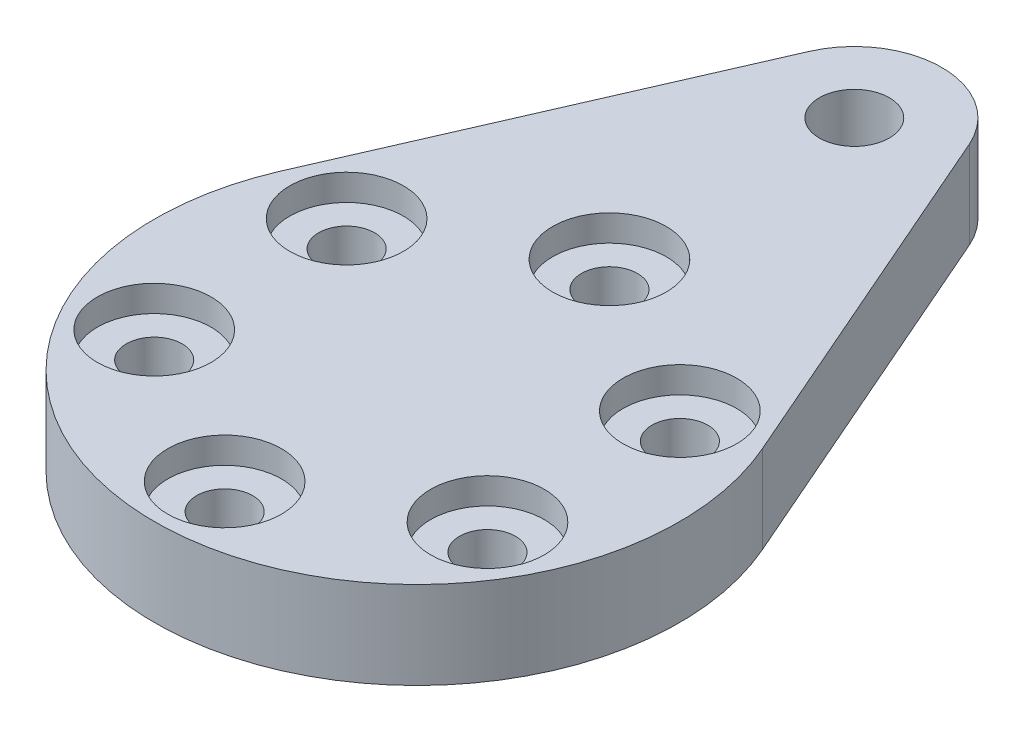
ISO-10303-21;
HEADER;
FILE_DESCRIPTION(('STEP AP214'),'2;1');
FILE_NAME('part.step','',(''),(''),'','','');
FILE_SCHEMA(('AUTOMOTIVE_DESIGN { 1 0 10303 214 1 1 1 1 }'));
ENDSEC;
DATA;
#1=APPLICATION_CONTEXT('core data for automotive mechanical design processes');
#2=APPLICATION_PROTOCOL_DEFINITION('international standard','automotive_design',2000,#1);
#3=PRODUCT_CONTEXT('',#1,'mechanical');
#4=PRODUCT('Part','Part','',(#3));
#5=PRODUCT_RELATED_PRODUCT_CATEGORY('part','',(#4));
#6=PRODUCT_DEFINITION_FORMATION('','',#4);
#7=PRODUCT_DEFINITION_CONTEXT('part definition',#1,'design');
#8=PRODUCT_DEFINITION('design','',#6,#7);
#9=PRODUCT_DEFINITION_SHAPE('','',#8);
#10=(LENGTH_UNIT() NAMED_UNIT(*) SI_UNIT(.MILLI.,.METRE.));
#11=(NAMED_UNIT(*) PLANE_ANGLE_UNIT() SI_UNIT($,.RADIAN.));
#12=(NAMED_UNIT(*) SI_UNIT($,.STERADIAN.) SOLID_ANGLE_UNIT());
#13=UNCERTAINTY_MEASURE_WITH_UNIT(LENGTH_MEASURE(1.E-05),#10,'distance_accuracy_value','');
#14=(GEOMETRIC_REPRESENTATION_CONTEXT(3) GLOBAL_UNCERTAINTY_ASSIGNED_CONTEXT((#13)) GLOBAL_UNIT_ASSIGNED_CONTEXT((#10,
#11,#12)) REPRESENTATION_CONTEXT('',''));
#15=CARTESIAN_POINT('',(0.,0.,0.));
#16=DIRECTION('',(0.,0.,1.));
#17=DIRECTION('',(1.,0.,0.));
#18=AXIS2_PLACEMENT_3D('',#15,#16,#17);
#19=CARTESIAN_POINT('',(9.52627944162909,5.,-5.50000000000046));
#20=DIRECTION('',(0.,-1.,0.));
#21=DIRECTION('',(0.,0.,-1.));
#22=AXIS2_PLACEMENT_3D('',#19,#20,#21);
#23=CYLINDRICAL_SURFACE('',#22,1.6);
#24=CARTESIAN_POINT('',(9.52627944162909,0.,-5.50000000000046));
#25=DIRECTION('',(0.,1.,0.));
#26=DIRECTION('',(0.,0.,1.));
#27=AXIS2_PLACEMENT_3D('',#24,#25,#26);
#28=CIRCLE('',#27,1.6);
#29=CARTESIAN_POINT('',(9.52627944162909,0.,-3.90000000000046));
#30=VERTEX_POINT('',#29);
#31=EDGE_CURVE('E125',#30,#30,#28,.T.);
#32=ORIENTED_EDGE('',*,*,#31,.F.);
#33=EDGE_LOOP('',(#32));
#34=FACE_BOUND('',#33,.T.);
#35=CARTESIAN_POINT('',(9.52627944162909,3.5,-5.50000000000046));
#36=DIRECTION('',(0.,1.,0.));
#37=DIRECTION('',(0.,0.,1.));
#38=AXIS2_PLACEMENT_3D('',#35,#36,#37);
#39=CIRCLE('',#38,1.6);
#40=CARTESIAN_POINT('',(9.52627944162909,3.5,-3.90000000000046));
#41=VERTEX_POINT('',#40);
#42=EDGE_CURVE('E39',#41,#41,#39,.T.);
#43=ORIENTED_EDGE('',*,*,#42,.T.);
#44=EDGE_LOOP('',(#43));
#45=FACE_BOUND('',#44,.T.);
#46=ADVANCED_FACE('F35',(#34,#45),#23,.F.);
#47=CARTESIAN_POINT('',(9.52627944162962,5.,5.49999999999954));
#48=DIRECTION('',(0.,-1.,0.));
#49=DIRECTION('',(0.,0.,-1.));
#50=AXIS2_PLACEMENT_3D('',#47,#48,#49);
#51=CYLINDRICAL_SURFACE('',#50,1.6);
#52=CARTESIAN_POINT('',(9.52627944162962,0.,5.49999999999954));
#53=DIRECTION('',(0.,1.,0.));
#54=DIRECTION('',(0.,0.,1.));
#55=AXIS2_PLACEMENT_3D('',#52,#53,#54);
#56=CIRCLE('',#55,1.6);
#57=CARTESIAN_POINT('',(9.52627944162962,0.,7.09999999999954));
#58=VERTEX_POINT('',#57);
#59=EDGE_CURVE('E122',#58,#58,#56,.T.);
#60=ORIENTED_EDGE('',*,*,#59,.F.);
#61=EDGE_LOOP('',(#60));
#62=FACE_BOUND('',#61,.T.);
#63=CARTESIAN_POINT('',(9.52627944162962,3.5,5.49999999999954));
#64=DIRECTION('',(0.,1.,0.));
#65=DIRECTION('',(0.,0.,1.));
#66=AXIS2_PLACEMENT_3D('',#63,#64,#65);
#67=CIRCLE('',#66,1.6);
#68=CARTESIAN_POINT('',(9.52627944162962,3.5,7.09999999999954));
#69=VERTEX_POINT('',#68);
#70=EDGE_CURVE('E146',#69,#69,#67,.T.);
#71=ORIENTED_EDGE('',*,*,#70,.T.);
#72=EDGE_LOOP('',(#71));
#73=FACE_BOUND('',#72,.T.);
#74=ADVANCED_FACE('F216',(#62,#73),#51,.F.);
#75=CARTESIAN_POINT('',(1.06103798112348E-12,5.,11.));
#76=DIRECTION('',(0.,-1.,0.));
#77=DIRECTION('',(0.,0.,-1.));
#78=AXIS2_PLACEMENT_3D('',#75,#76,#77);
#79=CYLINDRICAL_SURFACE('',#78,1.6);
#80=CARTESIAN_POINT('',(1.06103798112348E-12,0.,11.));
#81=DIRECTION('',(0.,1.,0.));
#82=DIRECTION('',(0.,0.,1.));
#83=AXIS2_PLACEMENT_3D('',#80,#81,#82);
#84=CIRCLE('',#83,1.6);
#85=CARTESIAN_POINT('',(1.06103798112348E-12,0.,12.6));
#86=VERTEX_POINT('',#85);
#87=EDGE_CURVE('E119',#86,#86,#84,.T.);
#88=ORIENTED_EDGE('',*,*,#87,.F.);
#89=EDGE_LOOP('',(#88));
#90=FACE_BOUND('',#89,.T.);
#91=CARTESIAN_POINT('',(1.06103798112348E-12,3.5,11.));
#92=DIRECTION('',(0.,1.,0.));
#93=DIRECTION('',(0.,0.,1.));
#94=AXIS2_PLACEMENT_3D('',#91,#92,#93);
#95=CIRCLE('',#94,1.6);
#96=CARTESIAN_POINT('',(1.06103798112348E-12,3.5,12.6));
#97=VERTEX_POINT('',#96);
#98=EDGE_CURVE('E144',#97,#97,#95,.T.);
#99=ORIENTED_EDGE('',*,*,#98,.T.);
#100=EDGE_LOOP('',(#99));
#101=FACE_BOUND('',#100,.T.);
#102=ADVANCED_FACE('F222',(#90,#101),#79,.F.);
#103=CARTESIAN_POINT('',(-9.52627944162803,5.,5.50000000000046));
#104=DIRECTION('',(0.,-1.,0.));
#105=DIRECTION('',(0.,0.,-1.));
#106=AXIS2_PLACEMENT_3D('',#103,#104,#105);
#107=CYLINDRICAL_SURFACE('',#106,1.6);
#108=CARTESIAN_POINT('',(-9.52627944162803,0.,5.50000000000046));
#109=DIRECTION('',(0.,1.,0.));
#110=DIRECTION('',(0.,0.,1.));
#111=AXIS2_PLACEMENT_3D('',#108,#109,#110);
#112=CIRCLE('',#111,1.6);
#113=CARTESIAN_POINT('',(-9.52627944162803,0.,7.10000000000046));
#114=VERTEX_POINT('',#113);
#115=EDGE_CURVE('E116',#114,#114,#112,.T.);
#116=ORIENTED_EDGE('',*,*,#115,.F.);
#117=EDGE_LOOP('',(#116));
#118=FACE_BOUND('',#117,.T.);
#119=CARTESIAN_POINT('',(-9.52627944162803,3.5,5.50000000000046));
#120=DIRECTION('',(0.,1.,0.));
#121=DIRECTION('',(0.,0.,1.));
#122=AXIS2_PLACEMENT_3D('',#119,#120,#121);
#123=CIRCLE('',#122,1.6);
#124=CARTESIAN_POINT('',(-9.52627944162803,3.5,7.10000000000046));
#125=VERTEX_POINT('',#124);
#126=EDGE_CURVE('E141',#125,#125,#123,.T.);
#127=ORIENTED_EDGE('',*,*,#126,.T.);
#128=EDGE_LOOP('',(#127));
#129=FACE_BOUND('',#128,.T.);
#130=ADVANCED_FACE('F231',(#118,#129),#107,.F.);
#131=CARTESIAN_POINT('',(-9.52627944162856,5.,-5.49999999999953));
#132=DIRECTION('',(0.,-1.,0.));
#133=DIRECTION('',(0.,0.,-1.));
#134=AXIS2_PLACEMENT_3D('',#131,#132,#133);
#135=CYLINDRICAL_SURFACE('',#134,1.6);
#136=CARTESIAN_POINT('',(-9.52627944162856,0.,-5.49999999999953));
#137=DIRECTION('',(0.,1.,0.));
#138=DIRECTION('',(0.,0.,1.));
#139=AXIS2_PLACEMENT_3D('',#136,#137,#138);
#140=CIRCLE('',#139,1.6);
#141=CARTESIAN_POINT('',(-9.52627944162856,0.,-3.89999999999953));
#142=VERTEX_POINT('',#141);
#143=EDGE_CURVE('E113',#142,#142,#140,.T.);
#144=ORIENTED_EDGE('',*,*,#143,.F.);
#145=EDGE_LOOP('',(#144));
#146=FACE_BOUND('',#145,.T.);
#147=CARTESIAN_POINT('',(-9.52627944162856,3.5,-5.49999999999953));
#148=DIRECTION('',(0.,1.,0.));
#149=DIRECTION('',(0.,0.,1.));
#150=AXIS2_PLACEMENT_3D('',#147,#148,#149);
#151=CIRCLE('',#150,1.6);
#152=CARTESIAN_POINT('',(-9.52627944162856,3.5,-3.89999999999953));
#153=VERTEX_POINT('',#152);
#154=EDGE_CURVE('E137',#153,#153,#151,.T.);
#155=ORIENTED_EDGE('',*,*,#154,.T.);
#156=EDGE_LOOP('',(#155));
#157=FACE_BOUND('',#156,.T.);
#158=ADVANCED_FACE('F235',(#146,#157),#135,.F.);
#159=CARTESIAN_POINT('',(0.,5.,-11.));
#160=DIRECTION('',(0.,-1.,0.));
#161=DIRECTION('',(0.,0.,-1.));
#162=AXIS2_PLACEMENT_3D('',#159,#160,#161);
#163=CYLINDRICAL_SURFACE('',#162,1.6);
#164=CARTESIAN_POINT('',(0.,0.,-11.));
#165=DIRECTION('',(0.,1.,0.));
#166=DIRECTION('',(0.,0.,1.));
#167=AXIS2_PLACEMENT_3D('',#164,#165,#166);
#168=CIRCLE('',#167,1.6);
#169=CARTESIAN_POINT('',(0.,0.,-9.4));
#170=VERTEX_POINT('',#169);
#171=EDGE_CURVE('E128',#170,#170,#168,.T.);
#172=ORIENTED_EDGE('',*,*,#171,.F.);
#173=EDGE_LOOP('',(#172));
#174=FACE_BOUND('',#173,.T.);
#175=CARTESIAN_POINT('',(0.,3.5,-11.));
#176=DIRECTION('',(0.,1.,0.));
#177=DIRECTION('',(0.,0.,1.));
#178=AXIS2_PLACEMENT_3D('',#175,#176,#177);
#179=CIRCLE('',#178,1.6);
#180=CARTESIAN_POINT('',(0.,3.5,-9.4));
#181=VERTEX_POINT('',#180);
#182=EDGE_CURVE('E134',#181,#181,#179,.T.);
#183=ORIENTED_EDGE('',*,*,#182,.T.);
#184=EDGE_LOOP('',(#183));
#185=FACE_BOUND('',#184,.T.);
#186=ADVANCED_FACE('F227',(#174,#185),#163,.F.);
#187=CARTESIAN_POINT('',(0.,5.,-25.));
#188=DIRECTION('',(0.,-1.,0.));
#189=DIRECTION('',(0.,0.,-1.));
#190=AXIS2_PLACEMENT_3D('',#187,#188,#189);
#191=CYLINDRICAL_SURFACE('',#190,5.);
#192=CARTESIAN_POINT('',(0.,0.,-25.));
#193=DIRECTION('',(0.,1.,0.));
#194=DIRECTION('',(0.,0.,1.));
#195=AXIS2_PLACEMENT_3D('',#192,#193,#194);
#196=CIRCLE('',#195,5.);
#197=CARTESIAN_POINT('',(4.58257569495584,0.,-27.));
#198=VERTEX_POINT('',#197);
#199=CARTESIAN_POINT('',(-4.58257569495584,0.,-27.));
#200=VERTEX_POINT('',#199);
#201=EDGE_CURVE('E105',#198,#200,#196,.T.);
#202=ORIENTED_EDGE('',*,*,#201,.T.);
#203=DIRECTION('',(0.,-1.,0.));
#204=VECTOR('',#203,1.);
#205=CARTESIAN_POINT('',(-4.58257569495584,5.,-27.));
#206=LINE('',#205,#204);
#207=CARTESIAN_POINT('',(-4.58257569495584,5.,-27.));
#208=VERTEX_POINT('',#207);
#209=EDGE_CURVE('E11',#208,#200,#206,.T.);
#210=ORIENTED_EDGE('',*,*,#209,.F.);
#211=CARTESIAN_POINT('',(0.,5.,-25.));
#212=DIRECTION('',(0.,1.,0.));
#213=DIRECTION('',(0.,0.,1.));
#214=AXIS2_PLACEMENT_3D('',#211,#212,#213);
#215=CIRCLE('',#214,5.);
#216=CARTESIAN_POINT('',(4.58257569495584,5.,-27.));
#217=VERTEX_POINT('',#216);
#218=EDGE_CURVE('E87',#217,#208,#215,.T.);
#219=ORIENTED_EDGE('',*,*,#218,.F.);
#220=DIRECTION('',(0.,-1.,0.));
#221=VECTOR('',#220,1.);
#222=CARTESIAN_POINT('',(4.58257569495584,5.,-27.));
#223=LINE('',#222,#221);
#224=EDGE_CURVE('E54',#217,#198,#223,.T.);
#225=ORIENTED_EDGE('',*,*,#224,.T.);
#226=EDGE_LOOP('',(#202,#210,#219,#225));
#227=FACE_BOUND('',#226,.T.);
#228=ADVANCED_FACE('F245',(#227),#191,.T.);
#229=CARTESIAN_POINT('',(-13.7477270848675,5.,-6.));
#230=DIRECTION('',(0.916515138991168,0.,0.4));
#231=DIRECTION('',(0.4,0.,-0.916515138991168));
#232=AXIS2_PLACEMENT_3D('',#229,#230,#231);
#233=PLANE('',#232);
#234=DIRECTION('',(-0.4,0.,0.916515138991168));
#235=VECTOR('',#234,1.);
#236=CARTESIAN_POINT('',(-13.7477270848675,0.,-6.));
#237=LINE('',#236,#235);
#238=CARTESIAN_POINT('',(-13.7477270848675,0.,-6.));
#239=VERTEX_POINT('',#238);
#240=EDGE_CURVE('E92',#200,#239,#237,.T.);
#241=ORIENTED_EDGE('',*,*,#240,.T.);
#242=DIRECTION('',(0.,-1.,0.));
#243=VECTOR('',#242,1.);
#244=CARTESIAN_POINT('',(-13.7477270848675,5.,-6.));
#245=LINE('',#244,#243);
#246=CARTESIAN_POINT('',(-13.7477270848675,5.,-6.));
#247=VERTEX_POINT('',#246);
#248=EDGE_CURVE('E45',#247,#239,#245,.T.);
#249=ORIENTED_EDGE('',*,*,#248,.F.);
#250=DIRECTION('',(-0.4,0.,0.916515138991168));
#251=VECTOR('',#250,1.);
#252=CARTESIAN_POINT('',(-13.7477270848675,5.,-6.));
#253=LINE('',#252,#251);
#254=EDGE_CURVE('E80',#208,#247,#253,.T.);
#255=ORIENTED_EDGE('',*,*,#254,.F.);
#256=ORIENTED_EDGE('',*,*,#209,.T.);
#257=EDGE_LOOP('',(#241,#249,#255,#256));
#258=FACE_BOUND('',#257,.T.);
#259=ADVANCED_FACE('F91',(#258),#233,.F.);
#260=CARTESIAN_POINT('',(0.,5.,0.));
#261=DIRECTION('',(0.,-1.,0.));
#262=DIRECTION('',(0.,0.,-1.));
#263=AXIS2_PLACEMENT_3D('',#260,#261,#262);
#264=CYLINDRICAL_SURFACE('',#263,15.);
#265=CARTESIAN_POINT('',(0.,0.,0.));
#266=DIRECTION('',(0.,1.,0.));
#267=DIRECTION('',(0.,0.,1.));
#268=AXIS2_PLACEMENT_3D('',#265,#266,#267);
#269=CIRCLE('',#268,15.);
#270=CARTESIAN_POINT('',(13.7477270848675,0.,-6.));
#271=VERTEX_POINT('',#270);
#272=EDGE_CURVE('E108',#239,#271,#269,.T.);
#273=ORIENTED_EDGE('',*,*,#272,.T.);
#274=DIRECTION('',(0.,-1.,0.));
#275=VECTOR('',#274,1.);
#276=CARTESIAN_POINT('',(13.7477270848675,5.,-6.));
#277=LINE('',#276,#275);
#278=CARTESIAN_POINT('',(13.7477270848675,5.,-6.));
#279=VERTEX_POINT('',#278);
#280=EDGE_CURVE('E69',#279,#271,#277,.T.);
#281=ORIENTED_EDGE('',*,*,#280,.F.);
#282=CARTESIAN_POINT('',(0.,5.,0.));
#283=DIRECTION('',(0.,1.,0.));
#284=DIRECTION('',(0.,0.,1.));
#285=AXIS2_PLACEMENT_3D('',#282,#283,#284);
#286=CIRCLE('',#285,15.);
#287=EDGE_CURVE('E86',#247,#279,#286,.T.);
#288=ORIENTED_EDGE('',*,*,#287,.F.);
#289=ORIENTED_EDGE('',*,*,#248,.T.);
#290=EDGE_LOOP('',(#273,#281,#288,#289));
#291=FACE_BOUND('',#290,.T.);
#292=ADVANCED_FACE('F96',(#291),#264,.T.);
#293=CARTESIAN_POINT('',(13.7477270848675,5.,-6.));
#294=DIRECTION('',(0.916515138991168,0.,-0.4));
#295=DIRECTION('',(-0.4,0.,-0.916515138991168));
#296=AXIS2_PLACEMENT_3D('',#293,#294,#295);
#297=PLANE('',#296);
#298=DIRECTION('',(0.4,0.,0.916515138991168));
#299=VECTOR('',#298,1.);
#300=CARTESIAN_POINT('',(13.7477270848675,0.,-6.));
#301=LINE('',#300,#299);
#302=EDGE_CURVE('E110',#198,#271,#301,.T.);
#303=ORIENTED_EDGE('',*,*,#302,.F.);
#304=ORIENTED_EDGE('',*,*,#224,.F.);
#305=DIRECTION('',(0.4,0.,0.916515138991168));
#306=VECTOR('',#305,1.);
#307=CARTESIAN_POINT('',(13.7477270848675,5.,-6.));
#308=LINE('',#307,#306);
#309=EDGE_CURVE('E97',#217,#279,#308,.T.);
#310=ORIENTED_EDGE('',*,*,#309,.T.);
#311=ORIENTED_EDGE('',*,*,#280,.T.);
#312=EDGE_LOOP('',(#303,#304,#310,#311));
#313=FACE_BOUND('',#312,.T.);
#314=ADVANCED_FACE('F211',(#313),#297,.T.);
#315=CARTESIAN_POINT('',(0.,5.,-25.));
#316=DIRECTION('',(0.,-1.,0.));
#317=DIRECTION('',(0.,0.,-1.));
#318=AXIS2_PLACEMENT_3D('',#315,#316,#317);
#319=CYLINDRICAL_SURFACE('',#318,2.);
#320=CARTESIAN_POINT('',(0.,5.,-25.));
#321=DIRECTION('',(0.,1.,0.));
#322=DIRECTION('',(0.,0.,1.));
#323=AXIS2_PLACEMENT_3D('',#320,#321,#322);
#324=CIRCLE('',#323,2.);
#325=CARTESIAN_POINT('',(0.,5.,-23.));
#326=VERTEX_POINT('',#325);
#327=EDGE_CURVE('E131',#326,#326,#324,.T.);
#328=ORIENTED_EDGE('',*,*,#327,.T.);
#329=EDGE_LOOP('',(#328));
#330=FACE_BOUND('',#329,.T.);
#331=CARTESIAN_POINT('',(0.,0.,-25.));
#332=DIRECTION('',(0.,1.,0.));
#333=DIRECTION('',(0.,0.,1.));
#334=AXIS2_PLACEMENT_3D('',#331,#332,#333);
#335=CIRCLE('',#334,2.);
#336=CARTESIAN_POINT('',(0.,0.,-23.));
#337=VERTEX_POINT('',#336);
#338=EDGE_CURVE('E102',#337,#337,#335,.T.);
#339=ORIENTED_EDGE('',*,*,#338,.F.);
#340=EDGE_LOOP('',(#339));
#341=FACE_BOUND('',#340,.T.);
#342=ADVANCED_FACE('F37',(#330,#341),#319,.F.);
#343=CARTESIAN_POINT('',(0.,5.,0.));
#344=DIRECTION('',(0.,1.,0.));
#345=DIRECTION('',(0.,0.,1.));
#346=AXIS2_PLACEMENT_3D('',#343,#344,#345);
#347=PLANE('',#346);
#348=CARTESIAN_POINT('',(9.52627944162882,5.,-5.5));
#349=DIRECTION('',(0.,1.,0.));
#350=DIRECTION('',(0.,0.,1.));
#351=AXIS2_PLACEMENT_3D('',#348,#349,#350);
#352=CIRCLE('',#351,3.25);
#353=CARTESIAN_POINT('',(9.52627944162882,5.,-2.25));
#354=VERTEX_POINT('',#353);
#355=EDGE_CURVE('E164',#354,#354,#352,.T.);
#356=ORIENTED_EDGE('',*,*,#355,.F.);
#357=EDGE_LOOP('',(#356));
#358=FACE_BOUND('',#357,.T.);
#359=CARTESIAN_POINT('',(9.52627944162883,5.,5.5));
#360=DIRECTION('',(0.,1.,0.));
#361=DIRECTION('',(0.,0.,1.));
#362=AXIS2_PLACEMENT_3D('',#359,#360,#361);
#363=CIRCLE('',#362,3.25);
#364=CARTESIAN_POINT('',(9.52627944162883,5.,8.75));
#365=VERTEX_POINT('',#364);
#366=EDGE_CURVE('E177',#365,#365,#363,.T.);
#367=ORIENTED_EDGE('',*,*,#366,.F.);
#368=EDGE_LOOP('',(#367));
#369=FACE_BOUND('',#368,.T.);
#370=CARTESIAN_POINT('',(0.,5.,11.));
#371=DIRECTION('',(0.,1.,0.));
#372=DIRECTION('',(0.,0.,1.));
#373=AXIS2_PLACEMENT_3D('',#370,#371,#372);
#374=CIRCLE('',#373,3.25);
#375=CARTESIAN_POINT('',(0.,5.,14.25));
#376=VERTEX_POINT('',#375);
#377=EDGE_CURVE('E183',#376,#376,#374,.T.);
#378=ORIENTED_EDGE('',*,*,#377,.F.);
#379=EDGE_LOOP('',(#378));
#380=FACE_BOUND('',#379,.T.);
#381=CARTESIAN_POINT('',(-9.52627944162882,5.,5.50000000000001));
#382=DIRECTION('',(0.,1.,0.));
#383=DIRECTION('',(0.,0.,1.));
#384=AXIS2_PLACEMENT_3D('',#381,#382,#383);
#385=CIRCLE('',#384,3.25);
#386=CARTESIAN_POINT('',(-9.52627944162882,5.,8.75));
#387=VERTEX_POINT('',#386);
#388=EDGE_CURVE('E189',#387,#387,#385,.T.);
#389=ORIENTED_EDGE('',*,*,#388,.F.);
#390=EDGE_LOOP('',(#389));
#391=FACE_BOUND('',#390,.T.);
#392=CARTESIAN_POINT('',(-9.52627944162883,5.,-5.49999999999999));
#393=DIRECTION('',(0.,1.,0.));
#394=DIRECTION('',(0.,0.,1.));
#395=AXIS2_PLACEMENT_3D('',#392,#393,#394);
#396=CIRCLE('',#395,3.25);
#397=CARTESIAN_POINT('',(-9.52627944162883,5.,-2.24999999999999));
#398=VERTEX_POINT('',#397);
#399=EDGE_CURVE('E172',#398,#398,#396,.T.);
#400=ORIENTED_EDGE('',*,*,#399,.F.);
#401=EDGE_LOOP('',(#400));
#402=FACE_BOUND('',#401,.T.);
#403=CARTESIAN_POINT('',(0.,5.,-11.));
#404=DIRECTION('',(0.,1.,0.));
#405=DIRECTION('',(0.,0.,1.));
#406=AXIS2_PLACEMENT_3D('',#403,#404,#405);
#407=CIRCLE('',#406,3.25);
#408=CARTESIAN_POINT('',(0.,5.,-7.75));
#409=VERTEX_POINT('',#408);
#410=EDGE_CURVE('E163',#409,#409,#407,.T.);
#411=ORIENTED_EDGE('',*,*,#410,.F.);
#412=EDGE_LOOP('',(#411));
#413=FACE_BOUND('',#412,.T.);
#414=ORIENTED_EDGE('',*,*,#327,.F.);
#415=EDGE_LOOP('',(#414));
#416=FACE_BOUND('',#415,.T.);
#417=ORIENTED_EDGE('',*,*,#218,.T.);
#418=ORIENTED_EDGE('',*,*,#254,.T.);
#419=ORIENTED_EDGE('',*,*,#287,.T.);
#420=ORIENTED_EDGE('',*,*,#309,.F.);
#421=EDGE_LOOP('',(#417,#418,#419,#420));
#422=FACE_BOUND('',#421,.T.);
#423=ADVANCED_FACE('F83',(#358,#369,#380,#391,#402,#413,#416,#422),#347,.T.);
#424=CARTESIAN_POINT('',(0.,0.,0.));
#425=DIRECTION('',(0.,1.,0.));
#426=DIRECTION('',(0.,0.,1.));
#427=AXIS2_PLACEMENT_3D('',#424,#425,#426);
#428=PLANE('',#427);
#429=ORIENTED_EDGE('',*,*,#338,.T.);
#430=EDGE_LOOP('',(#429));
#431=FACE_BOUND('',#430,.T.);
#432=ORIENTED_EDGE('',*,*,#201,.F.);
#433=ORIENTED_EDGE('',*,*,#302,.T.);
#434=ORIENTED_EDGE('',*,*,#272,.F.);
#435=ORIENTED_EDGE('',*,*,#240,.F.);
#436=EDGE_LOOP('',(#432,#433,#434,#435));
#437=FACE_BOUND('',#436,.T.);
#438=ORIENTED_EDGE('',*,*,#143,.T.);
#439=EDGE_LOOP('',(#438));
#440=FACE_BOUND('',#439,.T.);
#441=ORIENTED_EDGE('',*,*,#115,.T.);
#442=EDGE_LOOP('',(#441));
#443=FACE_BOUND('',#442,.T.);
#444=ORIENTED_EDGE('',*,*,#87,.T.);
#445=EDGE_LOOP('',(#444));
#446=FACE_BOUND('',#445,.T.);
#447=ORIENTED_EDGE('',*,*,#59,.T.);
#448=EDGE_LOOP('',(#447));
#449=FACE_BOUND('',#448,.T.);
#450=ORIENTED_EDGE('',*,*,#31,.T.);
#451=EDGE_LOOP('',(#450));
#452=FACE_BOUND('',#451,.T.);
#453=ORIENTED_EDGE('',*,*,#171,.T.);
#454=EDGE_LOOP('',(#453));
#455=FACE_BOUND('',#454,.T.);
#456=ADVANCED_FACE('F201',(#431,#437,#440,#443,#446,#449,#452,#455),#428,.F.);
#457=CARTESIAN_POINT('',(0.,3.5,-11.));
#458=DIRECTION('',(0.,1.,0.));
#459=DIRECTION('',(0.,0.,1.));
#460=AXIS2_PLACEMENT_3D('',#457,#458,#459);
#461=CYLINDRICAL_SURFACE('',#460,3.25);
#462=CARTESIAN_POINT('',(0.,3.5,-11.));
#463=DIRECTION('',(0.,1.,0.));
#464=DIRECTION('',(0.,0.,1.));
#465=AXIS2_PLACEMENT_3D('',#462,#463,#464);
#466=CIRCLE('',#465,3.25);
#467=CARTESIAN_POINT('',(0.,3.5,-7.75));
#468=VERTEX_POINT('',#467);
#469=EDGE_CURVE('E138',#468,#468,#466,.T.);
#470=ORIENTED_EDGE('',*,*,#469,.F.);
#471=EDGE_LOOP('',(#470));
#472=FACE_BOUND('',#471,.T.);
#473=ORIENTED_EDGE('',*,*,#410,.T.);
#474=EDGE_LOOP('',(#473));
#475=FACE_BOUND('',#474,.T.);
#476=ADVANCED_FACE('F208',(#472,#475),#461,.F.);
#477=CARTESIAN_POINT('',(0.,3.5,-11.));
#478=DIRECTION('',(0.,1.,0.));
#479=DIRECTION('',(0.,0.,1.));
#480=AXIS2_PLACEMENT_3D('',#477,#478,#479);
#481=PLANE('',#480);
#482=ORIENTED_EDGE('',*,*,#182,.F.);
#483=EDGE_LOOP('',(#482));
#484=FACE_BOUND('',#483,.T.);
#485=ORIENTED_EDGE('',*,*,#469,.T.);
#486=EDGE_LOOP('',(#485));
#487=FACE_BOUND('',#486,.T.);
#488=ADVANCED_FACE('F266',(#484,#487),#481,.T.);
#489=CARTESIAN_POINT('',(-9.52627944162883,3.5,-5.49999999999999));
#490=DIRECTION('',(0.,1.,0.));
#491=DIRECTION('',(0.,0.,1.));
#492=AXIS2_PLACEMENT_3D('',#489,#490,#491);
#493=CYLINDRICAL_SURFACE('',#492,3.25);
#494=CARTESIAN_POINT('',(-9.52627944162883,3.5,-5.49999999999999));
#495=DIRECTION('',(0.,1.,0.));
#496=DIRECTION('',(0.,0.,1.));
#497=AXIS2_PLACEMENT_3D('',#494,#495,#496);
#498=CIRCLE('',#497,3.25);
#499=CARTESIAN_POINT('',(-9.52627944162883,3.5,-2.24999999999999));
#500=VERTEX_POINT('',#499);
#501=EDGE_CURVE('E192',#500,#500,#498,.T.);
#502=ORIENTED_EDGE('',*,*,#501,.F.);
#503=EDGE_LOOP('',(#502));
#504=FACE_BOUND('',#503,.T.);
#505=ORIENTED_EDGE('',*,*,#399,.T.);
#506=EDGE_LOOP('',(#505));
#507=FACE_BOUND('',#506,.T.);
#508=ADVANCED_FACE('F269',(#504,#507),#493,.F.);
#509=CARTESIAN_POINT('',(-9.52627944162883,3.5,-5.49999999999999));
#510=DIRECTION('',(0.,1.,0.));
#511=DIRECTION('',(0.,0.,1.));
#512=AXIS2_PLACEMENT_3D('',#509,#510,#511);
#513=PLANE('',#512);
#514=ORIENTED_EDGE('',*,*,#154,.F.);
#515=EDGE_LOOP('',(#514));
#516=FACE_BOUND('',#515,.T.);
#517=ORIENTED_EDGE('',*,*,#501,.T.);
#518=EDGE_LOOP('',(#517));
#519=FACE_BOUND('',#518,.T.);
#520=ADVANCED_FACE('F284',(#516,#519),#513,.T.);
#521=CARTESIAN_POINT('',(-9.52627944162882,3.5,5.50000000000001));
#522=DIRECTION('',(0.,1.,0.));
#523=DIRECTION('',(0.,0.,1.));
#524=AXIS2_PLACEMENT_3D('',#521,#522,#523);
#525=CYLINDRICAL_SURFACE('',#524,3.25);
#526=CARTESIAN_POINT('',(-9.52627944162882,3.5,5.50000000000001));
#527=DIRECTION('',(0.,1.,0.));
#528=DIRECTION('',(0.,0.,1.));
#529=AXIS2_PLACEMENT_3D('',#526,#527,#528);
#530=CIRCLE('',#529,3.25);
#531=CARTESIAN_POINT('',(-9.52627944162882,3.5,8.75));
#532=VERTEX_POINT('',#531);
#533=EDGE_CURVE('E186',#532,#532,#530,.T.);
#534=ORIENTED_EDGE('',*,*,#533,.F.);
#535=EDGE_LOOP('',(#534));
#536=FACE_BOUND('',#535,.T.);
#537=ORIENTED_EDGE('',*,*,#388,.T.);
#538=EDGE_LOOP('',(#537));
#539=FACE_BOUND('',#538,.T.);
#540=ADVANCED_FACE('F280',(#536,#539),#525,.F.);
#541=CARTESIAN_POINT('',(-9.52627944162882,3.5,5.50000000000001));
#542=DIRECTION('',(0.,1.,0.));
#543=DIRECTION('',(0.,0.,1.));
#544=AXIS2_PLACEMENT_3D('',#541,#542,#543);
#545=PLANE('',#544);
#546=ORIENTED_EDGE('',*,*,#126,.F.);
#547=EDGE_LOOP('',(#546));
#548=FACE_BOUND('',#547,.T.);
#549=ORIENTED_EDGE('',*,*,#533,.T.);
#550=EDGE_LOOP('',(#549));
#551=FACE_BOUND('',#550,.T.);
#552=ADVANCED_FACE('F283',(#548,#551),#545,.T.);
#553=CARTESIAN_POINT('',(0.,3.5,11.));
#554=DIRECTION('',(0.,1.,0.));
#555=DIRECTION('',(0.,0.,1.));
#556=AXIS2_PLACEMENT_3D('',#553,#554,#555);
#557=CYLINDRICAL_SURFACE('',#556,3.25);
#558=CARTESIAN_POINT('',(0.,3.5,11.));
#559=DIRECTION('',(0.,1.,0.));
#560=DIRECTION('',(0.,0.,1.));
#561=AXIS2_PLACEMENT_3D('',#558,#559,#560);
#562=CIRCLE('',#561,3.25);
#563=CARTESIAN_POINT('',(0.,3.5,14.25));
#564=VERTEX_POINT('',#563);
#565=EDGE_CURVE('E180',#564,#564,#562,.T.);
#566=ORIENTED_EDGE('',*,*,#565,.F.);
#567=EDGE_LOOP('',(#566));
#568=FACE_BOUND('',#567,.T.);
#569=ORIENTED_EDGE('',*,*,#377,.T.);
#570=EDGE_LOOP('',(#569));
#571=FACE_BOUND('',#570,.T.);
#572=ADVANCED_FACE('F288',(#568,#571),#557,.F.);
#573=CARTESIAN_POINT('',(0.,3.5,11.));
#574=DIRECTION('',(0.,1.,0.));
#575=DIRECTION('',(0.,0.,1.));
#576=AXIS2_PLACEMENT_3D('',#573,#574,#575);
#577=PLANE('',#576);
#578=ORIENTED_EDGE('',*,*,#98,.F.);
#579=EDGE_LOOP('',(#578));
#580=FACE_BOUND('',#579,.T.);
#581=ORIENTED_EDGE('',*,*,#565,.T.);
#582=EDGE_LOOP('',(#581));
#583=FACE_BOUND('',#582,.T.);
#584=ADVANCED_FACE('F292',(#580,#583),#577,.T.);
#585=CARTESIAN_POINT('',(9.52627944162883,3.5,5.5));
#586=DIRECTION('',(0.,1.,0.));
#587=DIRECTION('',(0.,0.,1.));
#588=AXIS2_PLACEMENT_3D('',#585,#586,#587);
#589=CYLINDRICAL_SURFACE('',#588,3.25);
#590=CARTESIAN_POINT('',(9.52627944162883,3.5,5.5));
#591=DIRECTION('',(0.,1.,0.));
#592=DIRECTION('',(0.,0.,1.));
#593=AXIS2_PLACEMENT_3D('',#590,#591,#592);
#594=CIRCLE('',#593,3.25);
#595=CARTESIAN_POINT('',(9.52627944162883,3.5,8.75));
#596=VERTEX_POINT('',#595);
#597=EDGE_CURVE('E169',#596,#596,#594,.T.);
#598=ORIENTED_EDGE('',*,*,#597,.F.);
#599=EDGE_LOOP('',(#598));
#600=FACE_BOUND('',#599,.T.);
#601=ORIENTED_EDGE('',*,*,#366,.T.);
#602=EDGE_LOOP('',(#601));
#603=FACE_BOUND('',#602,.T.);
#604=ADVANCED_FACE('F296',(#600,#603),#589,.F.);
#605=CARTESIAN_POINT('',(9.52627944162883,3.5,5.5));
#606=DIRECTION('',(0.,1.,0.));
#607=DIRECTION('',(0.,0.,1.));
#608=AXIS2_PLACEMENT_3D('',#605,#606,#607);
#609=PLANE('',#608);
#610=ORIENTED_EDGE('',*,*,#70,.F.);
#611=EDGE_LOOP('',(#610));
#612=FACE_BOUND('',#611,.T.);
#613=ORIENTED_EDGE('',*,*,#597,.T.);
#614=EDGE_LOOP('',(#613));
#615=FACE_BOUND('',#614,.T.);
#616=ADVANCED_FACE('F300',(#612,#615),#609,.T.);
#617=CARTESIAN_POINT('',(9.52627944162882,3.5,-5.5));
#618=DIRECTION('',(0.,1.,0.));
#619=DIRECTION('',(0.,0.,1.));
#620=AXIS2_PLACEMENT_3D('',#617,#618,#619);
#621=CYLINDRICAL_SURFACE('',#620,3.25);
#622=CARTESIAN_POINT('',(9.52627944162882,3.5,-5.5));
#623=DIRECTION('',(0.,1.,0.));
#624=DIRECTION('',(0.,0.,1.));
#625=AXIS2_PLACEMENT_3D('',#622,#623,#624);
#626=CIRCLE('',#625,3.25);
#627=CARTESIAN_POINT('',(9.52627944162882,3.5,-2.25));
#628=VERTEX_POINT('',#627);
#629=EDGE_CURVE('E161',#628,#628,#626,.T.);
#630=ORIENTED_EDGE('',*,*,#629,.F.);
#631=EDGE_LOOP('',(#630));
#632=FACE_BOUND('',#631,.T.);
#633=ORIENTED_EDGE('',*,*,#355,.T.);
#634=EDGE_LOOP('',(#633));
#635=FACE_BOUND('',#634,.T.);
#636=ADVANCED_FACE('F157',(#632,#635),#621,.F.);
#637=CARTESIAN_POINT('',(9.52627944162882,3.5,-5.5));
#638=DIRECTION('',(0.,1.,0.));
#639=DIRECTION('',(0.,0.,1.));
#640=AXIS2_PLACEMENT_3D('',#637,#638,#639);
#641=PLANE('',#640);
#642=ORIENTED_EDGE('',*,*,#42,.F.);
#643=EDGE_LOOP('',(#642));
#644=FACE_BOUND('',#643,.T.);
#645=ORIENTED_EDGE('',*,*,#629,.T.);
#646=EDGE_LOOP('',(#645));
#647=FACE_BOUND('',#646,.T.);
#648=ADVANCED_FACE('F154',(#644,#647),#641,.T.);
#649=CLOSED_SHELL('',(#46,#74,#102,#130,#158,#186,#228,#259,#292,#314,#342,#423,#456,#476,#488,
#508,#520,#540,#552,#572,#584,#604,#616,#636,#648));
#650=MANIFOLD_SOLID_BREP('B2',#649);
#651=ADVANCED_BREP_SHAPE_REPRESENTATION('',(#18,#650),#14);
#652=SHAPE_DEFINITION_REPRESENTATION(#9,#651);
ENDSEC;
END-ISO-10303-21;
